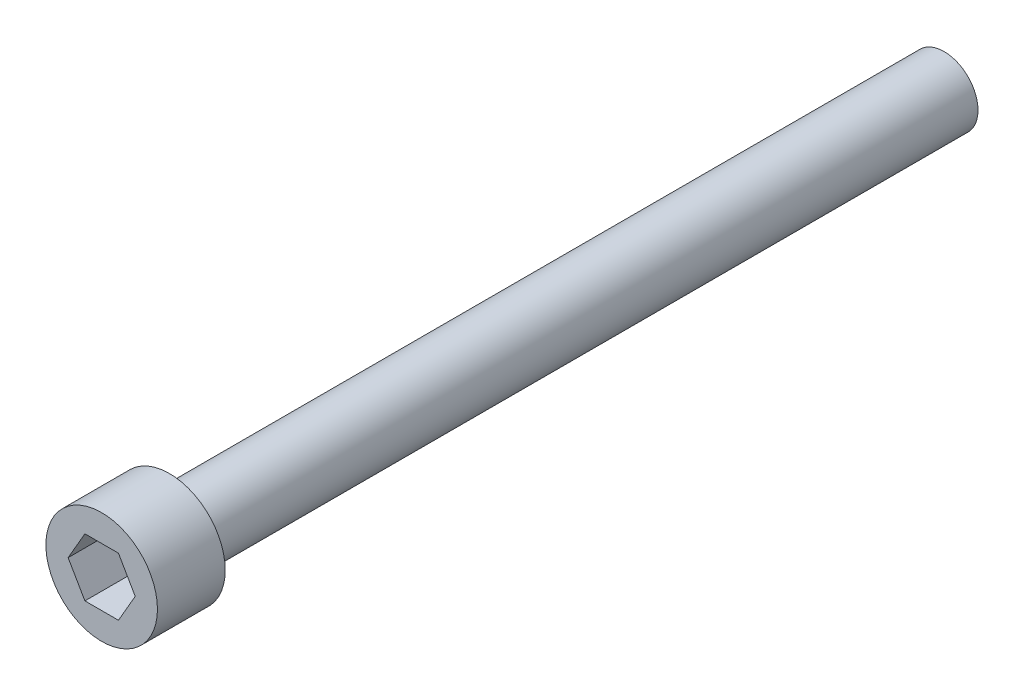
ISO-10303-21;
HEADER;
FILE_DESCRIPTION(('STEP AP214'),'2;1');
FILE_NAME('part.step','',(''),(''),'','','');
FILE_SCHEMA(('AUTOMOTIVE_DESIGN { 1 0 10303 214 1 1 1 1 }'));
ENDSEC;
DATA;
#1=APPLICATION_CONTEXT('core data for automotive mechanical design processes');
#2=APPLICATION_PROTOCOL_DEFINITION('international standard','automotive_design',2000,#1);
#3=PRODUCT_CONTEXT('',#1,'mechanical');
#4=PRODUCT('Part','Part','',(#3));
#5=PRODUCT_RELATED_PRODUCT_CATEGORY('part','',(#4));
#6=PRODUCT_DEFINITION_FORMATION('','',#4);
#7=PRODUCT_DEFINITION_CONTEXT('part definition',#1,'design');
#8=PRODUCT_DEFINITION('design','',#6,#7);
#9=PRODUCT_DEFINITION_SHAPE('','',#8);
#10=(LENGTH_UNIT() NAMED_UNIT(*) SI_UNIT(.MILLI.,.METRE.));
#11=(NAMED_UNIT(*) PLANE_ANGLE_UNIT() SI_UNIT($,.RADIAN.));
#12=(NAMED_UNIT(*) SI_UNIT($,.STERADIAN.) SOLID_ANGLE_UNIT());
#13=UNCERTAINTY_MEASURE_WITH_UNIT(LENGTH_MEASURE(1.E-05),#10,'distance_accuracy_value','');
#14=(GEOMETRIC_REPRESENTATION_CONTEXT(3) GLOBAL_UNCERTAINTY_ASSIGNED_CONTEXT((#13)) GLOBAL_UNIT_ASSIGNED_CONTEXT((#10,
#11,#12)) REPRESENTATION_CONTEXT('',''));
#15=CARTESIAN_POINT('',(0.,0.,0.));
#16=DIRECTION('',(0.,0.,1.));
#17=DIRECTION('',(1.,0.,0.));
#18=AXIS2_PLACEMENT_3D('',#15,#16,#17);
#19=CARTESIAN_POINT('',(3.42900000000001,0.,0.));
#20=DIRECTION('',(0.,0.,1.));
#21=DIRECTION('',(1.,0.,0.));
#22=AXIS2_PLACEMENT_3D('',#19,#20,#21);
#23=PLANE('',#22);
#24=DIRECTION('',(0.5,0.866025403784439,0.));
#25=VECTOR('',#24,1.);
#26=CARTESIAN_POINT('',(1.03111149638085,-1.7859375,0.));
#27=LINE('',#26,#25);
#28=CARTESIAN_POINT('',(1.03111149638085,-1.7859375,0.));
#29=VERTEX_POINT('',#28);
#30=CARTESIAN_POINT('',(2.06222299276169,0.,0.));
#31=VERTEX_POINT('',#30);
#32=EDGE_CURVE('E46',#29,#31,#27,.T.);
#33=ORIENTED_EDGE('',*,*,#32,.F.);
#34=DIRECTION('',(1.,0.,0.));
#35=VECTOR('',#34,1.);
#36=CARTESIAN_POINT('',(-1.03111149638085,-1.7859375,0.));
#37=LINE('',#36,#35);
#38=CARTESIAN_POINT('',(-1.03111149638085,-1.7859375,0.));
#39=VERTEX_POINT('',#38);
#40=EDGE_CURVE('E129',#39,#29,#37,.T.);
#41=ORIENTED_EDGE('',*,*,#40,.F.);
#42=DIRECTION('',(0.5,-0.866025403784439,0.));
#43=VECTOR('',#42,1.);
#44=CARTESIAN_POINT('',(-2.06222299276169,0.,0.));
#45=LINE('',#44,#43);
#46=CARTESIAN_POINT('',(-2.06222299276169,0.,0.));
#47=VERTEX_POINT('',#46);
#48=EDGE_CURVE('E127',#47,#39,#45,.T.);
#49=ORIENTED_EDGE('',*,*,#48,.F.);
#50=DIRECTION('',(-0.5,-0.866025403784439,0.));
#51=VECTOR('',#50,1.);
#52=CARTESIAN_POINT('',(-1.03111149638085,1.7859375,0.));
#53=LINE('',#52,#51);
#54=CARTESIAN_POINT('',(-1.03111149638085,1.7859375,0.));
#55=VERTEX_POINT('',#54);
#56=EDGE_CURVE('E94',#55,#47,#53,.T.);
#57=ORIENTED_EDGE('',*,*,#56,.F.);
#58=DIRECTION('',(-1.,0.,0.));
#59=VECTOR('',#58,1.);
#60=CARTESIAN_POINT('',(1.03111149638085,1.7859375,0.));
#61=LINE('',#60,#59);
#62=CARTESIAN_POINT('',(1.03111149638085,1.7859375,0.));
#63=VERTEX_POINT('',#62);
#64=EDGE_CURVE('E123',#63,#55,#61,.T.);
#65=ORIENTED_EDGE('',*,*,#64,.F.);
#66=DIRECTION('',(-0.5,0.866025403784438,0.));
#67=VECTOR('',#66,1.);
#68=CARTESIAN_POINT('',(2.06222299276169,0.,0.));
#69=LINE('',#68,#67);
#70=EDGE_CURVE('E120',#31,#63,#69,.T.);
#71=ORIENTED_EDGE('',*,*,#70,.F.);
#72=EDGE_LOOP('',(#33,#41,#49,#57,#65,#71));
#73=FACE_BOUND('',#72,.T.);
#74=CARTESIAN_POINT('',(0.,0.,0.));
#75=DIRECTION('',(0.,0.,1.));
#76=DIRECTION('',(1.,0.,0.));
#77=AXIS2_PLACEMENT_3D('',#74,#75,#76);
#78=CIRCLE('',#77,3.42900000000001);
#79=CARTESIAN_POINT('',(3.42900000000001,0.,0.));
#80=VERTEX_POINT('',#79);
#81=EDGE_CURVE('E133',#80,#80,#78,.T.);
#82=ORIENTED_EDGE('',*,*,#81,.T.);
#83=EDGE_LOOP('',(#82));
#84=FACE_BOUND('',#83,.T.);
#85=ADVANCED_FACE('F32',(#73,#84),#23,.T.);
#86=CARTESIAN_POINT('',(0.,0.,-51.7906));
#87=DIRECTION('',(0.,0.,-1.));
#88=DIRECTION('',(-1.,0.,0.));
#89=AXIS2_PLACEMENT_3D('',#86,#87,#88);
#90=PLANE('',#89);
#91=CARTESIAN_POINT('',(0.,0.,-51.7906));
#92=DIRECTION('',(0.,0.,1.));
#93=DIRECTION('',(1.,0.,0.));
#94=AXIS2_PLACEMENT_3D('',#91,#92,#93);
#95=CIRCLE('',#94,2.0828);
#96=CARTESIAN_POINT('',(2.08280000000001,0.,-51.7906));
#97=VERTEX_POINT('',#96);
#98=EDGE_CURVE('E11',#97,#97,#95,.T.);
#99=ORIENTED_EDGE('',*,*,#98,.F.);
#100=EDGE_LOOP('',(#99));
#101=FACE_BOUND('',#100,.T.);
#102=ADVANCED_FACE('F151',(#101),#90,.T.);
#103=CARTESIAN_POINT('',(0.,0.,0.));
#104=DIRECTION('',(0.,0.,1.));
#105=DIRECTION('',(1.,0.,0.));
#106=AXIS2_PLACEMENT_3D('',#103,#104,#105);
#107=CYLINDRICAL_SURFACE('',#106,2.08280000000001);
#108=ORIENTED_EDGE('',*,*,#98,.T.);
#109=EDGE_LOOP('',(#108));
#110=FACE_BOUND('',#109,.T.);
#111=CARTESIAN_POINT('',(0.,0.,-4.1656));
#112=DIRECTION('',(0.,0.,1.));
#113=DIRECTION('',(1.,0.,0.));
#114=AXIS2_PLACEMENT_3D('',#111,#112,#113);
#115=CIRCLE('',#114,2.08280000000001);
#116=CARTESIAN_POINT('',(2.08280000000001,0.,-4.1656));
#117=VERTEX_POINT('',#116);
#118=EDGE_CURVE('E39',#117,#117,#115,.T.);
#119=ORIENTED_EDGE('',*,*,#118,.F.);
#120=EDGE_LOOP('',(#119));
#121=FACE_BOUND('',#120,.T.);
#122=ADVANCED_FACE('F149',(#110,#121),#107,.T.);
#123=CARTESIAN_POINT('',(2.08280000000001,0.,-4.1656));
#124=DIRECTION('',(0.,0.,-1.));
#125=DIRECTION('',(-1.,0.,0.));
#126=AXIS2_PLACEMENT_3D('',#123,#124,#125);
#127=PLANE('',#126);
#128=ORIENTED_EDGE('',*,*,#118,.T.);
#129=EDGE_LOOP('',(#128));
#130=FACE_BOUND('',#129,.T.);
#131=CARTESIAN_POINT('',(0.,0.,-4.1656));
#132=DIRECTION('',(0.,0.,1.));
#133=DIRECTION('',(1.,0.,0.));
#134=AXIS2_PLACEMENT_3D('',#131,#132,#133);
#135=CIRCLE('',#134,3.429);
#136=CARTESIAN_POINT('',(3.429,0.,-4.1656));
#137=VERTEX_POINT('',#136);
#138=EDGE_CURVE('E141',#137,#137,#135,.T.);
#139=ORIENTED_EDGE('',*,*,#138,.F.);
#140=EDGE_LOOP('',(#139));
#141=FACE_BOUND('',#140,.T.);
#142=ADVANCED_FACE('F146',(#130,#141),#127,.T.);
#143=CARTESIAN_POINT('',(0.,0.,0.));
#144=DIRECTION('',(0.,0.,1.));
#145=DIRECTION('',(1.,0.,0.));
#146=AXIS2_PLACEMENT_3D('',#143,#144,#145);
#147=CYLINDRICAL_SURFACE('',#146,3.429);
#148=ORIENTED_EDGE('',*,*,#138,.T.);
#149=EDGE_LOOP('',(#148));
#150=FACE_BOUND('',#149,.T.);
#151=ORIENTED_EDGE('',*,*,#81,.F.);
#152=EDGE_LOOP('',(#151));
#153=FACE_BOUND('',#152,.T.);
#154=ADVANCED_FACE('F158',(#150,#153),#147,.T.);
#155=CARTESIAN_POINT('',(1.03111149638085,-1.7859375,-3.175));
#156=DIRECTION('',(0.866025403784439,-0.5,0.));
#157=DIRECTION('',(0.5,0.866025403784439,0.));
#158=AXIS2_PLACEMENT_3D('',#155,#156,#157);
#159=PLANE('',#158);
#160=ORIENTED_EDGE('',*,*,#32,.T.);
#161=DIRECTION('',(0.,0.,1.));
#162=VECTOR('',#161,1.);
#163=CARTESIAN_POINT('',(2.06222299276169,0.,-3.175));
#164=LINE('',#163,#162);
#165=CARTESIAN_POINT('',(2.06222299276169,0.,-3.175));
#166=VERTEX_POINT('',#165);
#167=EDGE_CURVE('E76',#166,#31,#164,.T.);
#168=ORIENTED_EDGE('',*,*,#167,.F.);
#169=DIRECTION('',(0.5,0.866025403784439,0.));
#170=VECTOR('',#169,1.);
#171=CARTESIAN_POINT('',(1.03111149638085,-1.7859375,-3.175));
#172=LINE('',#171,#170);
#173=CARTESIAN_POINT('',(1.03111149638085,-1.7859375,-3.175));
#174=VERTEX_POINT('',#173);
#175=EDGE_CURVE('E131',#174,#166,#172,.T.);
#176=ORIENTED_EDGE('',*,*,#175,.F.);
#177=DIRECTION('',(0.,0.,1.));
#178=VECTOR('',#177,1.);
#179=CARTESIAN_POINT('',(1.03111149638085,-1.7859375,-3.175));
#180=LINE('',#179,#178);
#181=EDGE_CURVE('E54',#174,#29,#180,.T.);
#182=ORIENTED_EDGE('',*,*,#181,.T.);
#183=EDGE_LOOP('',(#160,#168,#176,#182));
#184=FACE_BOUND('',#183,.T.);
#185=ADVANCED_FACE('F171',(#184),#159,.F.);
#186=CARTESIAN_POINT('',(-1.03111149638085,-1.7859375,-3.175));
#187=DIRECTION('',(0.,-1.,0.));
#188=DIRECTION('',(1.,0.,0.));
#189=AXIS2_PLACEMENT_3D('',#186,#187,#188);
#190=PLANE('',#189);
#191=ORIENTED_EDGE('',*,*,#40,.T.);
#192=ORIENTED_EDGE('',*,*,#181,.F.);
#193=DIRECTION('',(1.,0.,0.));
#194=VECTOR('',#193,1.);
#195=CARTESIAN_POINT('',(-1.03111149638085,-1.7859375,-3.175));
#196=LINE('',#195,#194);
#197=CARTESIAN_POINT('',(-1.03111149638085,-1.7859375,-3.175));
#198=VERTEX_POINT('',#197);
#199=EDGE_CURVE('E106',#198,#174,#196,.T.);
#200=ORIENTED_EDGE('',*,*,#199,.F.);
#201=DIRECTION('',(0.,0.,1.));
#202=VECTOR('',#201,1.);
#203=CARTESIAN_POINT('',(-1.03111149638085,-1.7859375,-3.175));
#204=LINE('',#203,#202);
#205=EDGE_CURVE('E98',#198,#39,#204,.T.);
#206=ORIENTED_EDGE('',*,*,#205,.T.);
#207=EDGE_LOOP('',(#191,#192,#200,#206));
#208=FACE_BOUND('',#207,.T.);
#209=ADVANCED_FACE('F177',(#208),#190,.F.);
#210=CARTESIAN_POINT('',(-2.06222299276169,0.,-3.175));
#211=DIRECTION('',(-0.866025403784439,-0.5,0.));
#212=DIRECTION('',(0.5,-0.866025403784439,0.));
#213=AXIS2_PLACEMENT_3D('',#210,#211,#212);
#214=PLANE('',#213);
#215=ORIENTED_EDGE('',*,*,#48,.T.);
#216=ORIENTED_EDGE('',*,*,#205,.F.);
#217=DIRECTION('',(0.5,-0.866025403784439,0.));
#218=VECTOR('',#217,1.);
#219=CARTESIAN_POINT('',(-2.06222299276169,0.,-3.175));
#220=LINE('',#219,#218);
#221=CARTESIAN_POINT('',(-2.06222299276169,0.,-3.175));
#222=VERTEX_POINT('',#221);
#223=EDGE_CURVE('E102',#222,#198,#220,.T.);
#224=ORIENTED_EDGE('',*,*,#223,.F.);
#225=DIRECTION('',(0.,0.,1.));
#226=VECTOR('',#225,1.);
#227=CARTESIAN_POINT('',(-2.06222299276169,0.,-3.175));
#228=LINE('',#227,#226);
#229=EDGE_CURVE('E87',#222,#47,#228,.T.);
#230=ORIENTED_EDGE('',*,*,#229,.T.);
#231=EDGE_LOOP('',(#215,#216,#224,#230));
#232=FACE_BOUND('',#231,.T.);
#233=ADVANCED_FACE('F103',(#232),#214,.F.);
#234=CARTESIAN_POINT('',(-1.03111149638085,1.7859375,-3.175));
#235=DIRECTION('',(-0.866025403784439,0.5,0.));
#236=DIRECTION('',(-0.5,-0.866025403784439,0.));
#237=AXIS2_PLACEMENT_3D('',#234,#235,#236);
#238=PLANE('',#237);
#239=ORIENTED_EDGE('',*,*,#56,.T.);
#240=ORIENTED_EDGE('',*,*,#229,.F.);
#241=DIRECTION('',(-0.5,-0.866025403784439,0.));
#242=VECTOR('',#241,1.);
#243=CARTESIAN_POINT('',(-1.03111149638085,1.7859375,-3.175));
#244=LINE('',#243,#242);
#245=CARTESIAN_POINT('',(-1.03111149638085,1.7859375,-3.175));
#246=VERTEX_POINT('',#245);
#247=EDGE_CURVE('E91',#246,#222,#244,.T.);
#248=ORIENTED_EDGE('',*,*,#247,.F.);
#249=DIRECTION('',(0.,0.,1.));
#250=VECTOR('',#249,1.);
#251=CARTESIAN_POINT('',(-1.03111149638085,1.7859375,-3.175));
#252=LINE('',#251,#250);
#253=EDGE_CURVE('E99',#246,#55,#252,.T.);
#254=ORIENTED_EDGE('',*,*,#253,.T.);
#255=EDGE_LOOP('',(#239,#240,#248,#254));
#256=FACE_BOUND('',#255,.T.);
#257=ADVANCED_FACE('F89',(#256),#238,.F.);
#258=CARTESIAN_POINT('',(1.03111149638085,1.7859375,-3.175));
#259=DIRECTION('',(0.,1.,0.));
#260=DIRECTION('',(0.,0.,1.));
#261=AXIS2_PLACEMENT_3D('',#258,#259,#260);
#262=PLANE('',#261);
#263=ORIENTED_EDGE('',*,*,#64,.T.);
#264=ORIENTED_EDGE('',*,*,#253,.F.);
#265=DIRECTION('',(-1.,0.,0.));
#266=VECTOR('',#265,1.);
#267=CARTESIAN_POINT('',(1.03111149638085,1.7859375,-3.175));
#268=LINE('',#267,#266);
#269=CARTESIAN_POINT('',(1.03111149638085,1.7859375,-3.175));
#270=VERTEX_POINT('',#269);
#271=EDGE_CURVE('E112',#270,#246,#268,.T.);
#272=ORIENTED_EDGE('',*,*,#271,.F.);
#273=DIRECTION('',(0.,0.,1.));
#274=VECTOR('',#273,1.);
#275=CARTESIAN_POINT('',(1.03111149638085,1.7859375,-3.175));
#276=LINE('',#275,#274);
#277=EDGE_CURVE('E136',#270,#63,#276,.T.);
#278=ORIENTED_EDGE('',*,*,#277,.T.);
#279=EDGE_LOOP('',(#263,#264,#272,#278));
#280=FACE_BOUND('',#279,.T.);
#281=ADVANCED_FACE('F183',(#280),#262,.F.);
#282=CARTESIAN_POINT('',(2.06222299276169,0.,-3.175));
#283=DIRECTION('',(0.866025403784438,0.5,0.));
#284=DIRECTION('',(-0.5,0.866025403784439,0.));
#285=AXIS2_PLACEMENT_3D('',#282,#283,#284);
#286=PLANE('',#285);
#287=ORIENTED_EDGE('',*,*,#70,.T.);
#288=ORIENTED_EDGE('',*,*,#277,.F.);
#289=DIRECTION('',(-0.5,0.866025403784438,0.));
#290=VECTOR('',#289,1.);
#291=CARTESIAN_POINT('',(2.06222299276169,0.,-3.175));
#292=LINE('',#291,#290);
#293=EDGE_CURVE('E114',#166,#270,#292,.T.);
#294=ORIENTED_EDGE('',*,*,#293,.F.);
#295=ORIENTED_EDGE('',*,*,#167,.T.);
#296=EDGE_LOOP('',(#287,#288,#294,#295));
#297=FACE_BOUND('',#296,.T.);
#298=ADVANCED_FACE('F180',(#297),#286,.F.);
#299=CARTESIAN_POINT('',(0.,0.,-3.175));
#300=DIRECTION('',(0.,0.,1.));
#301=DIRECTION('',(1.,0.,0.));
#302=AXIS2_PLACEMENT_3D('',#299,#300,#301);
#303=PLANE('',#302);
#304=ORIENTED_EDGE('',*,*,#175,.T.);
#305=ORIENTED_EDGE('',*,*,#293,.T.);
#306=ORIENTED_EDGE('',*,*,#271,.T.);
#307=ORIENTED_EDGE('',*,*,#247,.T.);
#308=ORIENTED_EDGE('',*,*,#223,.T.);
#309=ORIENTED_EDGE('',*,*,#199,.T.);
#310=EDGE_LOOP('',(#304,#305,#306,#307,#308,#309));
#311=FACE_BOUND('',#310,.T.);
#312=ADVANCED_FACE('F109',(#311),#303,.T.);
#313=CLOSED_SHELL('',(#85,#102,#122,#142,#154,#185,#209,#233,#257,#281,#298,#312));
#314=MANIFOLD_SOLID_BREP('B2',#313);
#315=ADVANCED_BREP_SHAPE_REPRESENTATION('',(#18,#314),#14);
#316=SHAPE_DEFINITION_REPRESENTATION(#9,#315);
ENDSEC;
END-ISO-10303-21;
